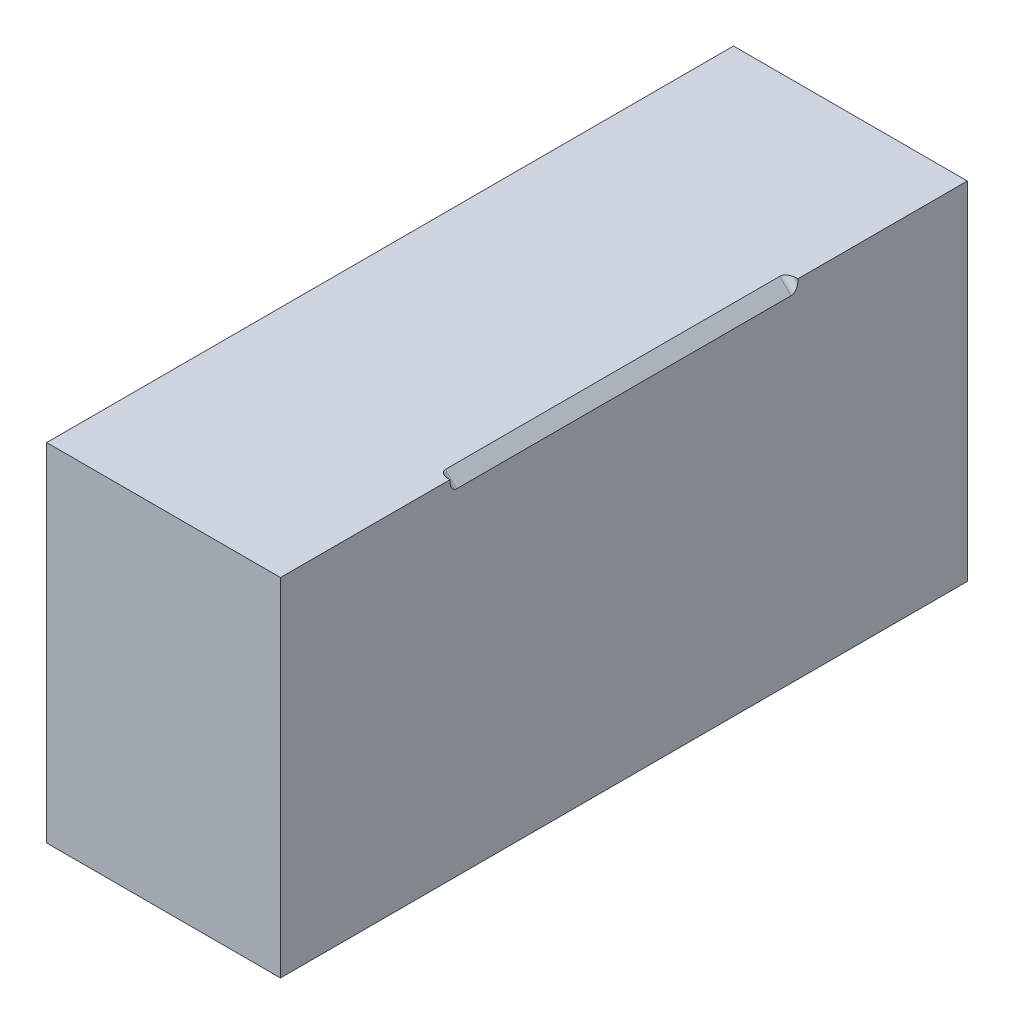
ISO-10303-21;
HEADER;
FILE_DESCRIPTION(('STEP AP214'),'2;1');
FILE_NAME('part.step','',(''),(''),'','','');
FILE_SCHEMA(('AUTOMOTIVE_DESIGN { 1 0 10303 214 1 1 1 1 }'));
ENDSEC;
DATA;
#1=APPLICATION_CONTEXT('core data for automotive mechanical design processes');
#2=APPLICATION_PROTOCOL_DEFINITION('international standard','automotive_design',2000,#1);
#3=PRODUCT_CONTEXT('',#1,'mechanical');
#4=PRODUCT('Part','Part','',(#3));
#5=PRODUCT_RELATED_PRODUCT_CATEGORY('part','',(#4));
#6=PRODUCT_DEFINITION_FORMATION('','',#4);
#7=PRODUCT_DEFINITION_CONTEXT('part definition',#1,'design');
#8=PRODUCT_DEFINITION('design','',#6,#7);
#9=PRODUCT_DEFINITION_SHAPE('','',#8);
#10=(LENGTH_UNIT() NAMED_UNIT(*) SI_UNIT(.MILLI.,.METRE.));
#11=(NAMED_UNIT(*) PLANE_ANGLE_UNIT() SI_UNIT($,.RADIAN.));
#12=(NAMED_UNIT(*) SI_UNIT($,.STERADIAN.) SOLID_ANGLE_UNIT());
#13=UNCERTAINTY_MEASURE_WITH_UNIT(LENGTH_MEASURE(1.E-05),#10,'distance_accuracy_value','');
#14=(GEOMETRIC_REPRESENTATION_CONTEXT(3) GLOBAL_UNCERTAINTY_ASSIGNED_CONTEXT((#13)) GLOBAL_UNIT_ASSIGNED_CONTEXT((#10,
#11,#12)) REPRESENTATION_CONTEXT('',''));
#15=CARTESIAN_POINT('',(0.,0.,0.));
#16=DIRECTION('',(0.,0.,1.));
#17=DIRECTION('',(1.,0.,0.));
#18=AXIS2_PLACEMENT_3D('',#15,#16,#17);
#19=CARTESIAN_POINT('',(-52.0807628707682,-77.253317535545,153.));
#20=DIRECTION('',(1.,0.,0.));
#21=DIRECTION('',(0.,0.,-1.));
#22=AXIS2_PLACEMENT_3D('',#19,#20,#21);
#23=PLANE('',#22);
#24=DIRECTION('',(0.,-1.,0.));
#25=VECTOR('',#24,1.);
#26=CARTESIAN_POINT('',(-52.0807628707682,-77.253317535545,-153.));
#27=LINE('',#26,#25);
#28=CARTESIAN_POINT('',(-52.0807628707682,77.253317535545,-153.));
#29=VERTEX_POINT('',#28);
#30=CARTESIAN_POINT('',(-52.0807628707682,-77.253317535545,-153.));
#31=VERTEX_POINT('',#30);
#32=EDGE_CURVE('E260',#29,#31,#27,.T.);
#33=ORIENTED_EDGE('',*,*,#32,.T.);
#34=DIRECTION('',(0.,0.,-1.));
#35=VECTOR('',#34,1.);
#36=CARTESIAN_POINT('',(-52.0807628707682,-77.253317535545,153.));
#37=LINE('',#36,#35);
#38=CARTESIAN_POINT('',(-52.0807628707682,-77.253317535545,153.));
#39=VERTEX_POINT('',#38);
#40=EDGE_CURVE('E132',#39,#31,#37,.T.);
#41=ORIENTED_EDGE('',*,*,#40,.F.);
#42=DIRECTION('',(0.,-1.,0.));
#43=VECTOR('',#42,1.);
#44=CARTESIAN_POINT('',(-52.0807628707682,-77.253317535545,153.));
#45=LINE('',#44,#43);
#46=CARTESIAN_POINT('',(-52.0807628707682,77.253317535545,153.));
#47=VERTEX_POINT('',#46);
#48=EDGE_CURVE('E266',#47,#39,#45,.T.);
#49=ORIENTED_EDGE('',*,*,#48,.F.);
#50=DIRECTION('',(0.,0.,-1.));
#51=VECTOR('',#50,1.);
#52=CARTESIAN_POINT('',(-52.0807628707682,77.253317535545,153.));
#53=LINE('',#52,#51);
#54=EDGE_CURVE('E122',#47,#29,#53,.T.);
#55=ORIENTED_EDGE('',*,*,#54,.T.);
#56=EDGE_LOOP('',(#33,#41,#49,#55));
#57=FACE_BOUND('',#56,.T.);
#58=ADVANCED_FACE('F33',(#57),#23,.F.);
#59=CARTESIAN_POINT('',(52.0807628707682,-77.253317535545,153.));
#60=DIRECTION('',(0.,1.,0.));
#61=DIRECTION('',(0.,0.,1.));
#62=AXIS2_PLACEMENT_3D('',#59,#60,#61);
#63=PLANE('',#62);
#64=DIRECTION('',(1.,0.,0.));
#65=VECTOR('',#64,1.);
#66=CARTESIAN_POINT('',(52.0807628707682,-77.253317535545,-153.));
#67=LINE('',#66,#65);
#68=CARTESIAN_POINT('',(52.0807628707682,-77.253317535545,-153.));
#69=VERTEX_POINT('',#68);
#70=EDGE_CURVE('E262',#31,#69,#67,.T.);
#71=ORIENTED_EDGE('',*,*,#70,.T.);
#72=DIRECTION('',(0.,0.,-1.));
#73=VECTOR('',#72,1.);
#74=CARTESIAN_POINT('',(52.0807628707682,-77.253317535545,153.));
#75=LINE('',#74,#73);
#76=CARTESIAN_POINT('',(52.0807628707682,-77.253317535545,153.));
#77=VERTEX_POINT('',#76);
#78=EDGE_CURVE('E125',#77,#69,#75,.T.);
#79=ORIENTED_EDGE('',*,*,#78,.F.);
#80=DIRECTION('',(1.,0.,0.));
#81=VECTOR('',#80,1.);
#82=CARTESIAN_POINT('',(52.0807628707682,-77.253317535545,153.));
#83=LINE('',#82,#81);
#84=EDGE_CURVE('E269',#39,#77,#83,.T.);
#85=ORIENTED_EDGE('',*,*,#84,.F.);
#86=ORIENTED_EDGE('',*,*,#40,.T.);
#87=EDGE_LOOP('',(#71,#79,#85,#86));
#88=FACE_BOUND('',#87,.T.);
#89=ADVANCED_FACE('F162',(#88),#63,.F.);
#90=CARTESIAN_POINT('',(52.0807628707682,-77.253317535545,153.));
#91=DIRECTION('',(-1.,0.,0.));
#92=DIRECTION('',(0.,0.,1.));
#93=AXIS2_PLACEMENT_3D('',#90,#91,#92);
#94=PLANE('',#93);
#95=DIRECTION('',(0.,0.,-1.));
#96=VECTOR('',#95,1.);
#97=CARTESIAN_POINT('',(52.0807628707682,77.253317535545,153.));
#98=LINE('',#97,#96);
#99=CARTESIAN_POINT('',(52.0807628707682,77.253317535545,-77.5));
#100=VERTEX_POINT('',#99);
#101=CARTESIAN_POINT('',(52.0807628707682,77.253317535545,-153.));
#102=VERTEX_POINT('',#101);
#103=EDGE_CURVE('E112',#100,#102,#98,.T.);
#104=ORIENTED_EDGE('',*,*,#103,.F.);
#105=DIRECTION('',(0.,1.,0.));
#106=VECTOR('',#105,1.);
#107=CARTESIAN_POINT('',(52.0807628707682,77.253317535545,-77.5));
#108=LINE('',#107,#106);
#109=CARTESIAN_POINT('',(52.0807628707682,76.4959582226643,-77.5));
#110=VERTEX_POINT('',#109);
#111=EDGE_CURVE('E103',#110,#100,#108,.T.);
#112=ORIENTED_EDGE('',*,*,#111,.F.);
#113=CARTESIAN_POINT('',(52.0807628707682,76.4959582226643,-74.5));
#114=DIRECTION('',(-1.,0.,0.));
#115=DIRECTION('',(0.,1.,0.));
#116=AXIS2_PLACEMENT_3D('',#113,#114,#115);
#117=ELLIPSE('',#116,4.24264068711929,3.);
#118=CARTESIAN_POINT('',(52.0807628707682,72.253317535545,-74.5));
#119=VERTEX_POINT('',#118);
#120=EDGE_CURVE('E41',#110,#119,#117,.T.);
#121=ORIENTED_EDGE('',*,*,#120,.T.);
#122=DIRECTION('',(0.,0.,1.));
#123=VECTOR('',#122,1.);
#124=CARTESIAN_POINT('',(52.0807628707682,72.253317535545,-77.5));
#125=LINE('',#124,#123);
#126=CARTESIAN_POINT('',(52.0807628707682,72.253317535545,74.5));
#127=VERTEX_POINT('',#126);
#128=EDGE_CURVE('E114',#119,#127,#125,.T.);
#129=ORIENTED_EDGE('',*,*,#128,.T.);
#130=CARTESIAN_POINT('',(52.0807628707682,76.4959582226643,74.5));
#131=DIRECTION('',(-1.,0.,0.));
#132=DIRECTION('',(0.,-1.,0.));
#133=AXIS2_PLACEMENT_3D('',#130,#131,#132);
#134=ELLIPSE('',#133,4.24264068711929,3.);
#135=CARTESIAN_POINT('',(52.0807628707682,76.4959582226643,77.5));
#136=VERTEX_POINT('',#135);
#137=EDGE_CURVE('E143',#127,#136,#134,.T.);
#138=ORIENTED_EDGE('',*,*,#137,.T.);
#139=DIRECTION('',(0.,1.,0.));
#140=VECTOR('',#139,1.);
#141=CARTESIAN_POINT('',(52.0807628707682,77.253317535545,77.5));
#142=LINE('',#141,#140);
#143=CARTESIAN_POINT('',(52.0807628707682,77.253317535545,77.5));
#144=VERTEX_POINT('',#143);
#145=EDGE_CURVE('E254',#136,#144,#142,.T.);
#146=ORIENTED_EDGE('',*,*,#145,.T.);
#147=CARTESIAN_POINT('',(52.0807628707682,77.253317535545,153.));
#148=VERTEX_POINT('',#147);
#149=EDGE_CURVE('E121',#148,#144,#98,.T.);
#150=ORIENTED_EDGE('',*,*,#149,.F.);
#151=DIRECTION('',(0.,1.,0.));
#152=VECTOR('',#151,1.);
#153=CARTESIAN_POINT('',(52.0807628707682,-77.253317535545,153.));
#154=LINE('',#153,#152);
#155=EDGE_CURVE('E272',#77,#148,#154,.T.);
#156=ORIENTED_EDGE('',*,*,#155,.F.);
#157=ORIENTED_EDGE('',*,*,#78,.T.);
#158=DIRECTION('',(0.,1.,0.));
#159=VECTOR('',#158,1.);
#160=CARTESIAN_POINT('',(52.0807628707682,-77.253317535545,-153.));
#161=LINE('',#160,#159);
#162=EDGE_CURVE('E119',#69,#102,#161,.T.);
#163=ORIENTED_EDGE('',*,*,#162,.T.);
#164=EDGE_LOOP('',(#104,#112,#121,#129,#138,#146,#150,#156,#157,#163));
#165=FACE_BOUND('',#164,.T.);
#166=ADVANCED_FACE('F116',(#165),#94,.F.);
#167=CARTESIAN_POINT('',(52.0807628707682,77.253317535545,153.));
#168=DIRECTION('',(0.,-1.,0.));
#169=DIRECTION('',(0.,0.,-1.));
#170=AXIS2_PLACEMENT_3D('',#167,#168,#169);
#171=PLANE('',#170);
#172=DIRECTION('',(0.,0.,1.));
#173=VECTOR('',#172,1.);
#174=CARTESIAN_POINT('',(47.0807628707682,77.253317535545,-77.5));
#175=LINE('',#174,#173);
#176=CARTESIAN_POINT('',(47.0807628707682,77.253317535545,-74.5));
#177=VERTEX_POINT('',#176);
#178=CARTESIAN_POINT('',(47.0807628707682,77.253317535545,74.5));
#179=VERTEX_POINT('',#178);
#180=EDGE_CURVE('E152',#177,#179,#175,.T.);
#181=ORIENTED_EDGE('',*,*,#180,.F.);
#182=CARTESIAN_POINT('',(51.3234035578875,77.253317535545,-74.5));
#183=DIRECTION('',(0.,-1.,0.));
#184=DIRECTION('',(-1.,0.,0.));
#185=AXIS2_PLACEMENT_3D('',#182,#183,#184);
#186=ELLIPSE('',#185,4.24264068711928,3.);
#187=CARTESIAN_POINT('',(51.3234035578875,77.253317535545,-77.5));
#188=VERTEX_POINT('',#187);
#189=EDGE_CURVE('E11',#177,#188,#186,.T.);
#190=ORIENTED_EDGE('',*,*,#189,.T.);
#191=DIRECTION('',(-1.,0.,0.));
#192=VECTOR('',#191,1.);
#193=CARTESIAN_POINT('',(47.0807628707682,77.253317535545,-77.5));
#194=LINE('',#193,#192);
#195=EDGE_CURVE('E105',#100,#188,#194,.T.);
#196=ORIENTED_EDGE('',*,*,#195,.F.);
#197=ORIENTED_EDGE('',*,*,#103,.T.);
#198=DIRECTION('',(-1.,0.,0.));
#199=VECTOR('',#198,1.);
#200=CARTESIAN_POINT('',(52.0807628707682,77.253317535545,-153.));
#201=LINE('',#200,#199);
#202=EDGE_CURVE('E270',#102,#29,#201,.T.);
#203=ORIENTED_EDGE('',*,*,#202,.T.);
#204=ORIENTED_EDGE('',*,*,#54,.F.);
#205=DIRECTION('',(-1.,0.,0.));
#206=VECTOR('',#205,1.);
#207=CARTESIAN_POINT('',(52.0807628707682,77.253317535545,153.));
#208=LINE('',#207,#206);
#209=EDGE_CURVE('E127',#148,#47,#208,.T.);
#210=ORIENTED_EDGE('',*,*,#209,.F.);
#211=ORIENTED_EDGE('',*,*,#149,.T.);
#212=DIRECTION('',(-1.,0.,0.));
#213=VECTOR('',#212,1.);
#214=CARTESIAN_POINT('',(47.0807628707682,77.253317535545,77.5));
#215=LINE('',#214,#213);
#216=CARTESIAN_POINT('',(51.3234035578875,77.253317535545,77.5));
#217=VERTEX_POINT('',#216);
#218=EDGE_CURVE('E109',#144,#217,#215,.T.);
#219=ORIENTED_EDGE('',*,*,#218,.T.);
#220=CARTESIAN_POINT('',(51.3234035578875,77.253317535545,74.5));
#221=DIRECTION('',(0.,-1.,0.));
#222=DIRECTION('',(1.,0.,0.));
#223=AXIS2_PLACEMENT_3D('',#220,#221,#222);
#224=ELLIPSE('',#223,4.24264068711928,3.);
#225=EDGE_CURVE('E145',#217,#179,#224,.T.);
#226=ORIENTED_EDGE('',*,*,#225,.T.);
#227=EDGE_LOOP('',(#181,#190,#196,#197,#203,#204,#210,#211,#219,#226));
#228=FACE_BOUND('',#227,.T.);
#229=ADVANCED_FACE('F111',(#228),#171,.F.);
#230=CARTESIAN_POINT('',(-52.0807628707682,77.253317535545,153.));
#231=DIRECTION('',(0.,0.,1.));
#232=DIRECTION('',(1.,0.,0.));
#233=AXIS2_PLACEMENT_3D('',#230,#231,#232);
#234=PLANE('',#233);
#235=ORIENTED_EDGE('',*,*,#48,.T.);
#236=ORIENTED_EDGE('',*,*,#84,.T.);
#237=ORIENTED_EDGE('',*,*,#155,.T.);
#238=ORIENTED_EDGE('',*,*,#209,.T.);
#239=EDGE_LOOP('',(#235,#236,#237,#238));
#240=FACE_BOUND('',#239,.T.);
#241=ADVANCED_FACE('F176',(#240),#234,.T.);
#242=CARTESIAN_POINT('',(-52.0807628707682,77.253317535545,-153.));
#243=DIRECTION('',(0.,0.,1.));
#244=DIRECTION('',(1.,0.,0.));
#245=AXIS2_PLACEMENT_3D('',#242,#243,#244);
#246=PLANE('',#245);
#247=ORIENTED_EDGE('',*,*,#32,.F.);
#248=ORIENTED_EDGE('',*,*,#202,.F.);
#249=ORIENTED_EDGE('',*,*,#162,.F.);
#250=ORIENTED_EDGE('',*,*,#70,.F.);
#251=EDGE_LOOP('',(#247,#248,#249,#250));
#252=FACE_BOUND('',#251,.T.);
#253=ADVANCED_FACE('F177',(#252),#246,.F.);
#254=CARTESIAN_POINT('',(52.0807628707682,72.253317535545,-77.5));
#255=DIRECTION('',(-0.707106781186548,-0.707106781186547,0.));
#256=DIRECTION('',(0.707106781186547,-0.707106781186548,0.));
#257=AXIS2_PLACEMENT_3D('',#254,#255,#256);
#258=PLANE('',#257);
#259=ORIENTED_EDGE('',*,*,#180,.T.);
#260=DIRECTION('',(0.707106781186547,-0.707106781186548,0.));
#261=VECTOR('',#260,1.);
#262=CARTESIAN_POINT('',(52.0807628707682,72.253317535545,74.5));
#263=LINE('',#262,#261);
#264=EDGE_CURVE('E137',#179,#127,#263,.T.);
#265=ORIENTED_EDGE('',*,*,#264,.T.);
#266=ORIENTED_EDGE('',*,*,#128,.F.);
#267=DIRECTION('',(0.707106781186547,-0.707106781186548,0.));
#268=VECTOR('',#267,1.);
#269=CARTESIAN_POINT('',(47.0807628707682,77.253317535545,-74.5));
#270=LINE('',#269,#268);
#271=EDGE_CURVE('E135',#119,#177,#270,.F.);
#272=ORIENTED_EDGE('',*,*,#271,.T.);
#273=EDGE_LOOP('',(#259,#265,#266,#272));
#274=FACE_BOUND('',#273,.T.);
#275=ADVANCED_FACE('F150',(#274),#258,.F.);
#276=CARTESIAN_POINT('',(47.0807628707682,77.253317535545,-77.5));
#277=DIRECTION('',(0.,0.,-1.));
#278=DIRECTION('',(-1.,0.,0.));
#279=AXIS2_PLACEMENT_3D('',#276,#277,#278);
#280=PLANE('',#279);
#281=ORIENTED_EDGE('',*,*,#195,.T.);
#282=DIRECTION('',(0.707106781186547,-0.707106781186548,0.));
#283=VECTOR('',#282,1.);
#284=CARTESIAN_POINT('',(54.2020832143278,74.3746378791047,-77.5));
#285=LINE('',#284,#283);
#286=EDGE_CURVE('E106',#188,#110,#285,.T.);
#287=ORIENTED_EDGE('',*,*,#286,.T.);
#288=ORIENTED_EDGE('',*,*,#111,.T.);
#289=EDGE_LOOP('',(#281,#287,#288));
#290=FACE_BOUND('',#289,.T.);
#291=ADVANCED_FACE('F104',(#290),#280,.F.);
#292=CARTESIAN_POINT('',(47.0807628707682,77.253317535545,77.5));
#293=DIRECTION('',(0.,0.,-1.));
#294=DIRECTION('',(-1.,0.,0.));
#295=AXIS2_PLACEMENT_3D('',#292,#293,#294);
#296=PLANE('',#295);
#297=ORIENTED_EDGE('',*,*,#145,.F.);
#298=DIRECTION('',(0.707106781186547,-0.707106781186548,0.));
#299=VECTOR('',#298,1.);
#300=CARTESIAN_POINT('',(49.2020832143278,79.3746378791047,77.5));
#301=LINE('',#300,#299);
#302=EDGE_CURVE('E140',#136,#217,#301,.F.);
#303=ORIENTED_EDGE('',*,*,#302,.T.);
#304=ORIENTED_EDGE('',*,*,#218,.F.);
#305=EDGE_LOOP('',(#297,#303,#304));
#306=FACE_BOUND('',#305,.T.);
#307=ADVANCED_FACE('F159',(#306),#296,.T.);
#308=CARTESIAN_POINT('',(54.2020832143278,74.3746378791047,74.5));
#309=DIRECTION('',(0.707106781186547,-0.707106781186548,0.));
#310=DIRECTION('',(0.707106781186548,0.707106781186547,0.));
#311=AXIS2_PLACEMENT_3D('',#308,#309,#310);
#312=CYLINDRICAL_SURFACE('',#311,3.);
#313=ORIENTED_EDGE('',*,*,#225,.F.);
#314=ORIENTED_EDGE('',*,*,#302,.F.);
#315=ORIENTED_EDGE('',*,*,#137,.F.);
#316=ORIENTED_EDGE('',*,*,#264,.F.);
#317=EDGE_LOOP('',(#313,#314,#315,#316));
#318=FACE_BOUND('',#317,.T.);
#319=ADVANCED_FACE('F155',(#318),#312,.F.);
#320=CARTESIAN_POINT('',(49.2020832143278,79.3746378791047,-74.5));
#321=DIRECTION('',(-0.707106781186547,0.707106781186548,0.));
#322=DIRECTION('',(-0.707106781186548,-0.707106781186547,0.));
#323=AXIS2_PLACEMENT_3D('',#320,#321,#322);
#324=CYLINDRICAL_SURFACE('',#323,3.);
#325=ORIENTED_EDGE('',*,*,#189,.F.);
#326=ORIENTED_EDGE('',*,*,#271,.F.);
#327=ORIENTED_EDGE('',*,*,#120,.F.);
#328=ORIENTED_EDGE('',*,*,#286,.F.);
#329=EDGE_LOOP('',(#325,#326,#327,#328));
#330=FACE_BOUND('',#329,.T.);
#331=ADVANCED_FACE('F35',(#330),#324,.F.);
#332=CLOSED_SHELL('',(#58,#89,#166,#229,#241,#253,#275,#291,#307,#319,#331));
#333=MANIFOLD_SOLID_BREP('B2',#332);
#334=ADVANCED_BREP_SHAPE_REPRESENTATION('',(#18,#333),#14);
#335=SHAPE_DEFINITION_REPRESENTATION(#9,#334);
ENDSEC;
END-ISO-10303-21;
